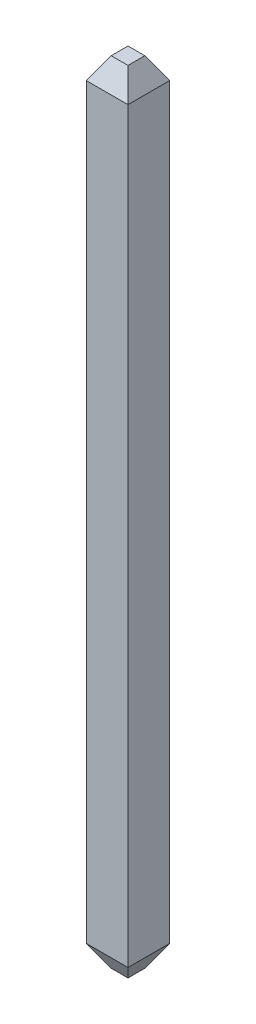
ISO-10303-21;
HEADER;
FILE_DESCRIPTION(('STEP AP214'),'2;1');
FILE_NAME('part.step','',(''),(''),'','','');
FILE_SCHEMA(('AUTOMOTIVE_DESIGN { 1 0 10303 214 1 1 1 1 }'));
ENDSEC;
DATA;
#1=APPLICATION_CONTEXT('core data for automotive mechanical design processes');
#2=APPLICATION_PROTOCOL_DEFINITION('international standard','automotive_design',2000,#1);
#3=PRODUCT_CONTEXT('',#1,'mechanical');
#4=PRODUCT('Part','Part','',(#3));
#5=PRODUCT_RELATED_PRODUCT_CATEGORY('part','',(#4));
#6=PRODUCT_DEFINITION_FORMATION('','',#4);
#7=PRODUCT_DEFINITION_CONTEXT('part definition',#1,'design');
#8=PRODUCT_DEFINITION('design','',#6,#7);
#9=PRODUCT_DEFINITION_SHAPE('','',#8);
#10=(LENGTH_UNIT() NAMED_UNIT(*) SI_UNIT(.MILLI.,.METRE.));
#11=(NAMED_UNIT(*) PLANE_ANGLE_UNIT() SI_UNIT($,.RADIAN.));
#12=(NAMED_UNIT(*) SI_UNIT($,.STERADIAN.) SOLID_ANGLE_UNIT());
#13=UNCERTAINTY_MEASURE_WITH_UNIT(LENGTH_MEASURE(1.E-05),#10,'distance_accuracy_value','');
#14=(GEOMETRIC_REPRESENTATION_CONTEXT(3) GLOBAL_UNCERTAINTY_ASSIGNED_CONTEXT((#13)) GLOBAL_UNIT_ASSIGNED_CONTEXT((#10,
#11,#12)) REPRESENTATION_CONTEXT('',''));
#15=CARTESIAN_POINT('',(0.,0.,0.));
#16=DIRECTION('',(0.,0.,1.));
#17=DIRECTION('',(1.,0.,0.));
#18=AXIS2_PLACEMENT_3D('',#15,#16,#17);
#19=CARTESIAN_POINT('',(-0.135,12.7,0.));
#20=DIRECTION('',(-0.86602540378444,0.499999999999998,0.));
#21=DIRECTION('',(-0.499999999999998,-0.86602540378444,0.));
#22=AXIS2_PLACEMENT_3D('',#19,#20,#21);
#23=PLANE('',#22);
#24=DIRECTION('',(0.44721359549994,0.774596669241492,0.447213595499961));
#25=VECTOR('',#24,1.);
#26=CARTESIAN_POINT('',(-0.335,12.3535898384862,-0.33500000000001));
#27=LINE('',#26,#25);
#28=CARTESIAN_POINT('',(-0.335000000000005,12.3535898384862,-0.335000000000003));
#29=VERTEX_POINT('',#28);
#30=CARTESIAN_POINT('',(-0.135,12.7,-0.135000000000001));
#31=VERTEX_POINT('',#30);
#32=EDGE_CURVE('E78',#29,#31,#27,.T.);
#33=ORIENTED_EDGE('',*,*,#32,.F.);
#34=DIRECTION('',(0.,0.,-1.));
#35=VECTOR('',#34,1.);
#36=CARTESIAN_POINT('',(-0.335,12.3535898384862,-0.335));
#37=LINE('',#36,#35);
#38=CARTESIAN_POINT('',(-0.335000000000005,12.3535898384862,0.335000000000001));
#39=VERTEX_POINT('',#38);
#40=EDGE_CURVE('E93',#29,#39,#37,.F.);
#41=ORIENTED_EDGE('',*,*,#40,.T.);
#42=DIRECTION('',(-0.44721359549994,-0.774596669241492,0.447213595499961));
#43=VECTOR('',#42,1.);
#44=CARTESIAN_POINT('',(-0.135,12.7,0.135));
#45=LINE('',#44,#43);
#46=CARTESIAN_POINT('',(-0.135,12.7,0.135));
#47=VERTEX_POINT('',#46);
#48=EDGE_CURVE('E19',#47,#39,#45,.T.);
#49=ORIENTED_EDGE('',*,*,#48,.F.);
#50=DIRECTION('',(0.,0.,1.));
#51=VECTOR('',#50,1.);
#52=CARTESIAN_POINT('',(-0.135,12.7,0.));
#53=LINE('',#52,#51);
#54=EDGE_CURVE('E83',#31,#47,#53,.T.);
#55=ORIENTED_EDGE('',*,*,#54,.F.);
#56=EDGE_LOOP('',(#33,#41,#49,#55));
#57=FACE_BOUND('',#56,.T.);
#58=ADVANCED_FACE('F16',(#57),#23,.T.);
#59=CARTESIAN_POINT('',(-0.335,0.346410161513777,-0.335));
#60=DIRECTION('',(0.866025403784439,0.5,0.));
#61=DIRECTION('',(-0.5,0.866025403784439,0.));
#62=AXIS2_PLACEMENT_3D('',#59,#60,#61);
#63=PLANE('',#62);
#64=DIRECTION('',(0.447213595499957,-0.774596669241484,0.447213595499958));
#65=VECTOR('',#64,1.);
#66=CARTESIAN_POINT('',(-0.335,0.346410161513777,-0.335));
#67=LINE('',#66,#65);
#68=CARTESIAN_POINT('',(-0.335,0.346410161513777,-0.335));
#69=VERTEX_POINT('',#68);
#70=CARTESIAN_POINT('',(-0.135,0.,-0.135));
#71=VERTEX_POINT('',#70);
#72=EDGE_CURVE('E111',#69,#71,#67,.T.);
#73=ORIENTED_EDGE('',*,*,#72,.T.);
#74=DIRECTION('',(0.,0.,1.));
#75=VECTOR('',#74,1.);
#76=CARTESIAN_POINT('',(-0.135,0.,0.));
#77=LINE('',#76,#75);
#78=CARTESIAN_POINT('',(-0.135,0.,0.134999999999999));
#79=VERTEX_POINT('',#78);
#80=EDGE_CURVE('E114',#71,#79,#77,.T.);
#81=ORIENTED_EDGE('',*,*,#80,.T.);
#82=DIRECTION('',(-0.447213595499956,0.774596669241484,0.447213595499958));
#83=VECTOR('',#82,1.);
#84=CARTESIAN_POINT('',(-0.135,0.,0.134999999999999));
#85=LINE('',#84,#83);
#86=CARTESIAN_POINT('',(-0.335,0.346410161513777,0.335));
#87=VERTEX_POINT('',#86);
#88=EDGE_CURVE('E108',#79,#87,#85,.T.);
#89=ORIENTED_EDGE('',*,*,#88,.T.);
#90=DIRECTION('',(0.,0.,-1.));
#91=VECTOR('',#90,1.);
#92=CARTESIAN_POINT('',(-0.335,0.346410161513776,-0.335));
#93=LINE('',#92,#91);
#94=EDGE_CURVE('E105',#87,#69,#93,.T.);
#95=ORIENTED_EDGE('',*,*,#94,.T.);
#96=EDGE_LOOP('',(#73,#81,#89,#95));
#97=FACE_BOUND('',#96,.T.);
#98=ADVANCED_FACE('F177',(#97),#63,.F.);
#99=CARTESIAN_POINT('',(0.,12.7,0.135));
#100=DIRECTION('',(0.,0.499999999999998,0.86602540378444));
#101=DIRECTION('',(0.,-0.86602540378444,0.499999999999998));
#102=AXIS2_PLACEMENT_3D('',#99,#100,#101);
#103=PLANE('',#102);
#104=ORIENTED_EDGE('',*,*,#48,.T.);
#105=DIRECTION('',(-1.,0.,0.));
#106=VECTOR('',#105,1.);
#107=CARTESIAN_POINT('',(-0.335,12.3535898384862,0.335));
#108=LINE('',#107,#106);
#109=CARTESIAN_POINT('',(0.335000000000001,12.3535898384862,0.335000000000005));
#110=VERTEX_POINT('',#109);
#111=EDGE_CURVE('E126',#39,#110,#108,.F.);
#112=ORIENTED_EDGE('',*,*,#111,.T.);
#113=DIRECTION('',(0.447213595499961,-0.774596669241492,0.44721359549994));
#114=VECTOR('',#113,1.);
#115=CARTESIAN_POINT('',(0.135,12.7,0.135));
#116=LINE('',#115,#114);
#117=CARTESIAN_POINT('',(0.135,12.7,0.135));
#118=VERTEX_POINT('',#117);
#119=EDGE_CURVE('E99',#118,#110,#116,.T.);
#120=ORIENTED_EDGE('',*,*,#119,.F.);
#121=DIRECTION('',(1.,0.,0.));
#122=VECTOR('',#121,1.);
#123=CARTESIAN_POINT('',(0.,12.7,0.135));
#124=LINE('',#123,#122);
#125=EDGE_CURVE('E88',#47,#118,#124,.T.);
#126=ORIENTED_EDGE('',*,*,#125,.F.);
#127=EDGE_LOOP('',(#104,#112,#120,#126));
#128=FACE_BOUND('',#127,.T.);
#129=ADVANCED_FACE('F98',(#128),#103,.T.);
#130=CARTESIAN_POINT('',(0.,12.7,0.));
#131=DIRECTION('',(0.,1.,0.));
#132=DIRECTION('',(0.,0.,1.));
#133=AXIS2_PLACEMENT_3D('',#130,#131,#132);
#134=PLANE('',#133);
#135=ORIENTED_EDGE('',*,*,#54,.T.);
#136=ORIENTED_EDGE('',*,*,#125,.T.);
#137=DIRECTION('',(0.,0.,1.));
#138=VECTOR('',#137,1.);
#139=CARTESIAN_POINT('',(0.135,12.7,0.));
#140=LINE('',#139,#138);
#141=CARTESIAN_POINT('',(0.135,12.7,-0.135000000000001));
#142=VERTEX_POINT('',#141);
#143=EDGE_CURVE('E135',#142,#118,#140,.T.);
#144=ORIENTED_EDGE('',*,*,#143,.F.);
#145=DIRECTION('',(1.,0.,0.));
#146=VECTOR('',#145,1.);
#147=CARTESIAN_POINT('',(0.,12.7,-0.135000000000001));
#148=LINE('',#147,#146);
#149=EDGE_CURVE('E90',#31,#142,#148,.T.);
#150=ORIENTED_EDGE('',*,*,#149,.F.);
#151=EDGE_LOOP('',(#135,#136,#144,#150));
#152=FACE_BOUND('',#151,.T.);
#153=ADVANCED_FACE('F85',(#152),#134,.T.);
#154=CARTESIAN_POINT('',(0.,12.7,-0.135000000000001));
#155=DIRECTION('',(0.,0.499999999999998,-0.86602540378444));
#156=DIRECTION('',(0.,0.86602540378444,0.499999999999998));
#157=AXIS2_PLACEMENT_3D('',#154,#155,#156);
#158=PLANE('',#157);
#159=DIRECTION('',(-0.447213595499961,0.774596669241493,0.447213595499938));
#160=VECTOR('',#159,1.);
#161=CARTESIAN_POINT('',(0.335000000000009,12.3535898384862,-0.335));
#162=LINE('',#161,#160);
#163=CARTESIAN_POINT('',(0.335000000000002,12.3535898384862,-0.335000000000005));
#164=VERTEX_POINT('',#163);
#165=EDGE_CURVE('E132',#164,#142,#162,.T.);
#166=ORIENTED_EDGE('',*,*,#165,.F.);
#167=DIRECTION('',(1.,0.,0.));
#168=VECTOR('',#167,1.);
#169=CARTESIAN_POINT('',(-0.335,12.3535898384862,-0.335));
#170=LINE('',#169,#168);
#171=EDGE_CURVE('E137',#164,#29,#170,.F.);
#172=ORIENTED_EDGE('',*,*,#171,.T.);
#173=ORIENTED_EDGE('',*,*,#32,.T.);
#174=ORIENTED_EDGE('',*,*,#149,.T.);
#175=EDGE_LOOP('',(#166,#172,#173,#174));
#176=FACE_BOUND('',#175,.T.);
#177=ADVANCED_FACE('F208',(#176),#158,.T.);
#178=CARTESIAN_POINT('',(-0.335,12.7,-0.335));
#179=DIRECTION('',(1.,0.,0.));
#180=DIRECTION('',(0.,0.,-1.));
#181=AXIS2_PLACEMENT_3D('',#178,#179,#180);
#182=PLANE('',#181);
#183=DIRECTION('',(0.,1.,0.));
#184=VECTOR('',#183,1.);
#185=CARTESIAN_POINT('',(-0.335,12.7,0.335));
#186=LINE('',#185,#184);
#187=EDGE_CURVE('E123',#87,#39,#186,.T.);
#188=ORIENTED_EDGE('',*,*,#187,.T.);
#189=ORIENTED_EDGE('',*,*,#40,.F.);
#190=DIRECTION('',(0.,1.,0.));
#191=VECTOR('',#190,1.);
#192=CARTESIAN_POINT('',(-0.335,12.7,-0.335));
#193=LINE('',#192,#191);
#194=EDGE_CURVE('E139',#29,#69,#193,.F.);
#195=ORIENTED_EDGE('',*,*,#194,.T.);
#196=ORIENTED_EDGE('',*,*,#94,.F.);
#197=EDGE_LOOP('',(#188,#189,#195,#196));
#198=FACE_BOUND('',#197,.T.);
#199=ADVANCED_FACE('F175',(#198),#182,.F.);
#200=CARTESIAN_POINT('',(-0.335,0.346410161513777,0.335));
#201=DIRECTION('',(0.,0.5,-0.866025403784439));
#202=DIRECTION('',(0.,0.866025403784439,0.5));
#203=AXIS2_PLACEMENT_3D('',#200,#201,#202);
#204=PLANE('',#203);
#205=DIRECTION('',(0.447213595499958,0.774596669241483,0.447213595499958));
#206=VECTOR('',#205,1.);
#207=CARTESIAN_POINT('',(0.134999999999999,0.,0.134999999999999));
#208=LINE('',#207,#206);
#209=CARTESIAN_POINT('',(0.135,0.,0.134999999999999));
#210=VERTEX_POINT('',#209);
#211=CARTESIAN_POINT('',(0.335,0.346410161513777,0.335));
#212=VERTEX_POINT('',#211);
#213=EDGE_CURVE('E144',#210,#212,#208,.T.);
#214=ORIENTED_EDGE('',*,*,#213,.T.);
#215=DIRECTION('',(-1.,0.,0.));
#216=VECTOR('',#215,1.);
#217=CARTESIAN_POINT('',(-0.335,0.346410161513776,0.335));
#218=LINE('',#217,#216);
#219=EDGE_CURVE('E128',#212,#87,#218,.T.);
#220=ORIENTED_EDGE('',*,*,#219,.T.);
#221=ORIENTED_EDGE('',*,*,#88,.F.);
#222=DIRECTION('',(1.,0.,0.));
#223=VECTOR('',#222,1.);
#224=CARTESIAN_POINT('',(0.,0.,0.134999999999999));
#225=LINE('',#224,#223);
#226=EDGE_CURVE('E117',#79,#210,#225,.T.);
#227=ORIENTED_EDGE('',*,*,#226,.T.);
#228=EDGE_LOOP('',(#214,#220,#221,#227));
#229=FACE_BOUND('',#228,.T.);
#230=ADVANCED_FACE('F180',(#229),#204,.F.);
#231=CARTESIAN_POINT('',(-0.335,0.346410161513777,-0.335));
#232=DIRECTION('',(0.,0.5,0.866025403784439));
#233=DIRECTION('',(0.,-0.866025403784439,0.5));
#234=AXIS2_PLACEMENT_3D('',#231,#232,#233);
#235=PLANE('',#234);
#236=ORIENTED_EDGE('',*,*,#72,.F.);
#237=DIRECTION('',(1.,0.,0.));
#238=VECTOR('',#237,1.);
#239=CARTESIAN_POINT('',(-0.335,0.346410161513776,-0.335));
#240=LINE('',#239,#238);
#241=CARTESIAN_POINT('',(0.335,0.346410161513777,-0.335));
#242=VERTEX_POINT('',#241);
#243=EDGE_CURVE('E142',#69,#242,#240,.T.);
#244=ORIENTED_EDGE('',*,*,#243,.T.);
#245=DIRECTION('',(-0.447213595499958,-0.774596669241484,0.447213595499957));
#246=VECTOR('',#245,1.);
#247=CARTESIAN_POINT('',(0.335,0.346410161513777,-0.335));
#248=LINE('',#247,#246);
#249=CARTESIAN_POINT('',(0.135,0.,-0.135));
#250=VERTEX_POINT('',#249);
#251=EDGE_CURVE('E33',#242,#250,#248,.T.);
#252=ORIENTED_EDGE('',*,*,#251,.T.);
#253=DIRECTION('',(1.,0.,0.));
#254=VECTOR('',#253,1.);
#255=CARTESIAN_POINT('',(0.,0.,-0.135));
#256=LINE('',#255,#254);
#257=EDGE_CURVE('E120',#250,#71,#256,.F.);
#258=ORIENTED_EDGE('',*,*,#257,.T.);
#259=EDGE_LOOP('',(#236,#244,#252,#258));
#260=FACE_BOUND('',#259,.T.);
#261=ADVANCED_FACE('F199',(#260),#235,.F.);
#262=CARTESIAN_POINT('',(0.,0.,0.));
#263=DIRECTION('',(0.,1.,0.));
#264=DIRECTION('',(0.,0.,1.));
#265=AXIS2_PLACEMENT_3D('',#262,#263,#264);
#266=PLANE('',#265);
#267=DIRECTION('',(0.,0.,1.));
#268=VECTOR('',#267,1.);
#269=CARTESIAN_POINT('',(0.134999999999999,0.,-0.335));
#270=LINE('',#269,#268);
#271=EDGE_CURVE('E148',#250,#210,#270,.T.);
#272=ORIENTED_EDGE('',*,*,#271,.T.);
#273=ORIENTED_EDGE('',*,*,#226,.F.);
#274=ORIENTED_EDGE('',*,*,#80,.F.);
#275=ORIENTED_EDGE('',*,*,#257,.F.);
#276=EDGE_LOOP('',(#272,#273,#274,#275));
#277=FACE_BOUND('',#276,.T.);
#278=ADVANCED_FACE('F196',(#277),#266,.F.);
#279=CARTESIAN_POINT('',(-0.335,12.7,0.335));
#280=DIRECTION('',(0.,0.,-1.));
#281=DIRECTION('',(-1.,0.,0.));
#282=AXIS2_PLACEMENT_3D('',#279,#280,#281);
#283=PLANE('',#282);
#284=DIRECTION('',(0.,1.,0.));
#285=VECTOR('',#284,1.);
#286=CARTESIAN_POINT('',(0.335,12.7,0.335));
#287=LINE('',#286,#285);
#288=EDGE_CURVE('E151',#212,#110,#287,.T.);
#289=ORIENTED_EDGE('',*,*,#288,.T.);
#290=ORIENTED_EDGE('',*,*,#111,.F.);
#291=ORIENTED_EDGE('',*,*,#187,.F.);
#292=ORIENTED_EDGE('',*,*,#219,.F.);
#293=EDGE_LOOP('',(#289,#290,#291,#292));
#294=FACE_BOUND('',#293,.T.);
#295=ADVANCED_FACE('F173',(#294),#283,.F.);
#296=CARTESIAN_POINT('',(0.135,12.7,0.));
#297=DIRECTION('',(0.86602540378444,0.499999999999998,0.));
#298=DIRECTION('',(-0.499999999999998,0.86602540378444,0.));
#299=AXIS2_PLACEMENT_3D('',#296,#297,#298);
#300=PLANE('',#299);
#301=ORIENTED_EDGE('',*,*,#165,.T.);
#302=ORIENTED_EDGE('',*,*,#143,.T.);
#303=ORIENTED_EDGE('',*,*,#119,.T.);
#304=DIRECTION('',(0.,0.,1.));
#305=VECTOR('',#304,1.);
#306=CARTESIAN_POINT('',(0.335,12.3535898384862,-0.335));
#307=LINE('',#306,#305);
#308=EDGE_CURVE('E154',#110,#164,#307,.F.);
#309=ORIENTED_EDGE('',*,*,#308,.T.);
#310=EDGE_LOOP('',(#301,#302,#303,#309));
#311=FACE_BOUND('',#310,.T.);
#312=ADVANCED_FACE('F170',(#311),#300,.T.);
#313=CARTESIAN_POINT('',(-0.335,12.7,-0.335));
#314=DIRECTION('',(0.,0.,1.));
#315=DIRECTION('',(1.,0.,0.));
#316=AXIS2_PLACEMENT_3D('',#313,#314,#315);
#317=PLANE('',#316);
#318=ORIENTED_EDGE('',*,*,#194,.F.);
#319=ORIENTED_EDGE('',*,*,#171,.F.);
#320=DIRECTION('',(0.,1.,0.));
#321=VECTOR('',#320,1.);
#322=CARTESIAN_POINT('',(0.335,12.7,-0.335));
#323=LINE('',#322,#321);
#324=EDGE_CURVE('E25',#164,#242,#323,.F.);
#325=ORIENTED_EDGE('',*,*,#324,.T.);
#326=ORIENTED_EDGE('',*,*,#243,.F.);
#327=EDGE_LOOP('',(#318,#319,#325,#326));
#328=FACE_BOUND('',#327,.T.);
#329=ADVANCED_FACE('F162',(#328),#317,.F.);
#330=CARTESIAN_POINT('',(0.335,0.346410161513777,-0.335));
#331=DIRECTION('',(-0.866025403784439,0.5,0.));
#332=DIRECTION('',(-0.5,-0.866025403784439,0.));
#333=AXIS2_PLACEMENT_3D('',#330,#331,#332);
#334=PLANE('',#333);
#335=ORIENTED_EDGE('',*,*,#251,.F.);
#336=DIRECTION('',(0.,0.,1.));
#337=VECTOR('',#336,1.);
#338=CARTESIAN_POINT('',(0.335,0.346410161513776,-0.335));
#339=LINE('',#338,#337);
#340=EDGE_CURVE('E11',#242,#212,#339,.T.);
#341=ORIENTED_EDGE('',*,*,#340,.T.);
#342=ORIENTED_EDGE('',*,*,#213,.F.);
#343=ORIENTED_EDGE('',*,*,#271,.F.);
#344=EDGE_LOOP('',(#335,#341,#342,#343));
#345=FACE_BOUND('',#344,.T.);
#346=ADVANCED_FACE('F181',(#345),#334,.F.);
#347=CARTESIAN_POINT('',(0.335,12.7,-0.335));
#348=DIRECTION('',(-1.,0.,0.));
#349=DIRECTION('',(0.,0.,1.));
#350=AXIS2_PLACEMENT_3D('',#347,#348,#349);
#351=PLANE('',#350);
#352=ORIENTED_EDGE('',*,*,#324,.F.);
#353=ORIENTED_EDGE('',*,*,#308,.F.);
#354=ORIENTED_EDGE('',*,*,#288,.F.);
#355=ORIENTED_EDGE('',*,*,#340,.F.);
#356=EDGE_LOOP('',(#352,#353,#354,#355));
#357=FACE_BOUND('',#356,.T.);
#358=ADVANCED_FACE('F167',(#357),#351,.F.);
#359=CLOSED_SHELL('',(#58,#98,#129,#153,#177,#199,#230,#261,#278,#295,#312,#329,#346,#358));
#360=MANIFOLD_SOLID_BREP('B1',#359);
#361=ADVANCED_BREP_SHAPE_REPRESENTATION('',(#18,#360),#14);
#362=SHAPE_DEFINITION_REPRESENTATION(#9,#361);
ENDSEC;
END-ISO-10303-21;
